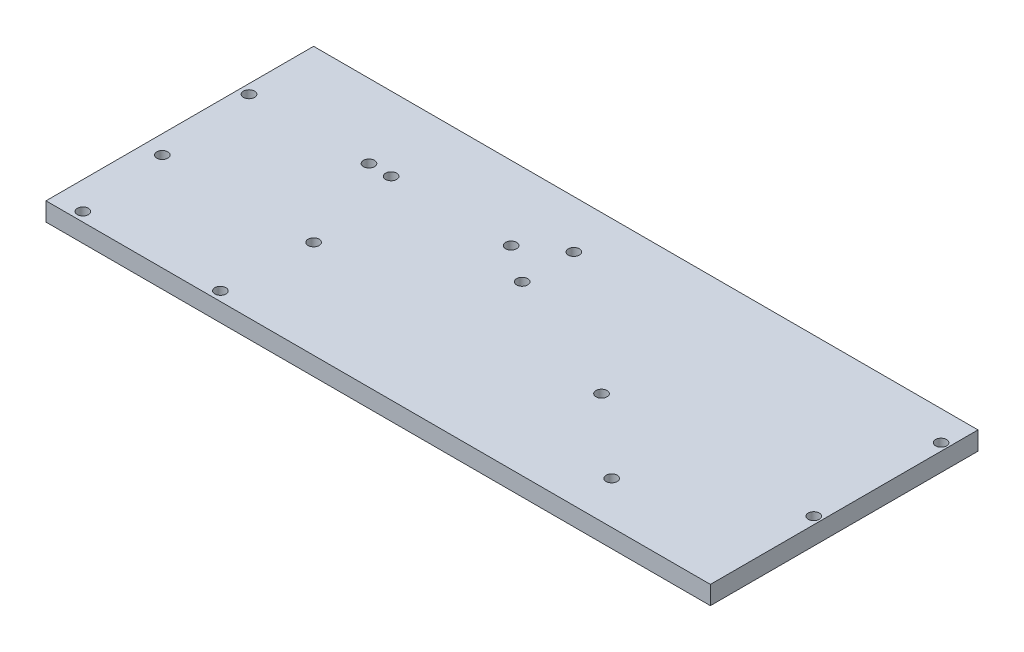
ISO-10303-21;
HEADER;
FILE_DESCRIPTION(('STEP AP214'),'2;1');
FILE_NAME('part.step','',(''),(''),'','','');
FILE_SCHEMA(('AUTOMOTIVE_DESIGN { 1 0 10303 214 1 1 1 1 }'));
ENDSEC;
DATA;
#1=APPLICATION_CONTEXT('core data for automotive mechanical design processes');
#2=APPLICATION_PROTOCOL_DEFINITION('international standard','automotive_design',2000,#1);
#3=PRODUCT_CONTEXT('',#1,'mechanical');
#4=PRODUCT('Part','Part','',(#3));
#5=PRODUCT_RELATED_PRODUCT_CATEGORY('part','',(#4));
#6=PRODUCT_DEFINITION_FORMATION('','',#4);
#7=PRODUCT_DEFINITION_CONTEXT('part definition',#1,'design');
#8=PRODUCT_DEFINITION('design','',#6,#7);
#9=PRODUCT_DEFINITION_SHAPE('','',#8);
#10=(LENGTH_UNIT() NAMED_UNIT(*) SI_UNIT(.MILLI.,.METRE.));
#11=(NAMED_UNIT(*) PLANE_ANGLE_UNIT() SI_UNIT($,.RADIAN.));
#12=(NAMED_UNIT(*) SI_UNIT($,.STERADIAN.) SOLID_ANGLE_UNIT());
#13=UNCERTAINTY_MEASURE_WITH_UNIT(LENGTH_MEASURE(1.E-05),#10,'distance_accuracy_value','');
#14=(GEOMETRIC_REPRESENTATION_CONTEXT(3) GLOBAL_UNCERTAINTY_ASSIGNED_CONTEXT((#13)) GLOBAL_UNIT_ASSIGNED_CONTEXT((#10,
#11,#12)) REPRESENTATION_CONTEXT('',''));
#15=CARTESIAN_POINT('',(0.,0.,0.));
#16=DIRECTION('',(0.,0.,1.));
#17=DIRECTION('',(1.,0.,0.));
#18=AXIS2_PLACEMENT_3D('',#15,#16,#17);
#19=CARTESIAN_POINT('',(0.,10.,0.));
#20=DIRECTION('',(0.,0.,-1.));
#21=DIRECTION('',(-1.,0.,0.));
#22=AXIS2_PLACEMENT_3D('',#19,#20,#21);
#23=PLANE('',#22);
#24=DIRECTION('',(1.,0.,0.));
#25=VECTOR('',#24,1.);
#26=CARTESIAN_POINT('',(0.,0.,0.));
#27=LINE('',#26,#25);
#28=CARTESIAN_POINT('',(0.,0.,0.));
#29=VERTEX_POINT('',#28);
#30=CARTESIAN_POINT('',(360.,0.,0.));
#31=VERTEX_POINT('',#30);
#32=EDGE_CURVE('E171',#29,#31,#27,.T.);
#33=ORIENTED_EDGE('',*,*,#32,.T.);
#34=DIRECTION('',(0.,-1.,0.));
#35=VECTOR('',#34,1.);
#36=CARTESIAN_POINT('',(360.,10.,0.));
#37=LINE('',#36,#35);
#38=CARTESIAN_POINT('',(360.,10.,0.));
#39=VERTEX_POINT('',#38);
#40=EDGE_CURVE('E11',#39,#31,#37,.T.);
#41=ORIENTED_EDGE('',*,*,#40,.F.);
#42=DIRECTION('',(1.,0.,0.));
#43=VECTOR('',#42,1.);
#44=CARTESIAN_POINT('',(0.,10.,0.));
#45=LINE('',#44,#43);
#46=CARTESIAN_POINT('',(0.,10.,0.));
#47=VERTEX_POINT('',#46);
#48=EDGE_CURVE('E97',#47,#39,#45,.T.);
#49=ORIENTED_EDGE('',*,*,#48,.F.);
#50=DIRECTION('',(0.,-1.,0.));
#51=VECTOR('',#50,1.);
#52=CARTESIAN_POINT('',(0.,10.,0.));
#53=LINE('',#52,#51);
#54=EDGE_CURVE('E63',#47,#29,#53,.T.);
#55=ORIENTED_EDGE('',*,*,#54,.T.);
#56=EDGE_LOOP('',(#33,#41,#49,#55));
#57=FACE_BOUND('',#56,.T.);
#58=ADVANCED_FACE('F45',(#57),#23,.F.);
#59=CARTESIAN_POINT('',(360.,10.,0.));
#60=DIRECTION('',(-1.,0.,0.));
#61=DIRECTION('',(0.,0.,1.));
#62=AXIS2_PLACEMENT_3D('',#59,#60,#61);
#63=PLANE('',#62);
#64=DIRECTION('',(0.,0.,-1.));
#65=VECTOR('',#64,1.);
#66=CARTESIAN_POINT('',(360.,0.,0.));
#67=LINE('',#66,#65);
#68=CARTESIAN_POINT('',(360.,0.,-145.));
#69=VERTEX_POINT('',#68);
#70=EDGE_CURVE('E103',#31,#69,#67,.T.);
#71=ORIENTED_EDGE('',*,*,#70,.T.);
#72=DIRECTION('',(0.,-1.,0.));
#73=VECTOR('',#72,1.);
#74=CARTESIAN_POINT('',(360.,10.,-145.));
#75=LINE('',#74,#73);
#76=CARTESIAN_POINT('',(360.,10.,-145.));
#77=VERTEX_POINT('',#76);
#78=EDGE_CURVE('E55',#77,#69,#75,.T.);
#79=ORIENTED_EDGE('',*,*,#78,.F.);
#80=DIRECTION('',(0.,0.,-1.));
#81=VECTOR('',#80,1.);
#82=CARTESIAN_POINT('',(360.,10.,0.));
#83=LINE('',#82,#81);
#84=EDGE_CURVE('E88',#39,#77,#83,.T.);
#85=ORIENTED_EDGE('',*,*,#84,.F.);
#86=ORIENTED_EDGE('',*,*,#40,.T.);
#87=EDGE_LOOP('',(#71,#79,#85,#86));
#88=FACE_BOUND('',#87,.T.);
#89=ADVANCED_FACE('F102',(#88),#63,.F.);
#90=CARTESIAN_POINT('',(0.,10.,-145.));
#91=DIRECTION('',(0.,0.,-1.));
#92=DIRECTION('',(-1.,0.,0.));
#93=AXIS2_PLACEMENT_3D('',#90,#91,#92);
#94=PLANE('',#93);
#95=DIRECTION('',(1.,0.,0.));
#96=VECTOR('',#95,1.);
#97=CARTESIAN_POINT('',(0.,0.,-145.));
#98=LINE('',#97,#96);
#99=CARTESIAN_POINT('',(0.,0.,-145.));
#100=VERTEX_POINT('',#99);
#101=EDGE_CURVE('E176',#100,#69,#98,.T.);
#102=ORIENTED_EDGE('',*,*,#101,.F.);
#103=DIRECTION('',(0.,-1.,0.));
#104=VECTOR('',#103,1.);
#105=CARTESIAN_POINT('',(0.,10.,-145.));
#106=LINE('',#105,#104);
#107=CARTESIAN_POINT('',(0.,10.,-145.));
#108=VERTEX_POINT('',#107);
#109=EDGE_CURVE('E77',#108,#100,#106,.T.);
#110=ORIENTED_EDGE('',*,*,#109,.F.);
#111=DIRECTION('',(1.,0.,0.));
#112=VECTOR('',#111,1.);
#113=CARTESIAN_POINT('',(0.,10.,-145.));
#114=LINE('',#113,#112);
#115=EDGE_CURVE('E96',#108,#77,#114,.T.);
#116=ORIENTED_EDGE('',*,*,#115,.T.);
#117=ORIENTED_EDGE('',*,*,#78,.T.);
#118=EDGE_LOOP('',(#102,#110,#116,#117));
#119=FACE_BOUND('',#118,.T.);
#120=ADVANCED_FACE('F107',(#119),#94,.T.);
#121=CARTESIAN_POINT('',(356.,10.,-129.));
#122=DIRECTION('',(0.,-1.,0.));
#123=DIRECTION('',(0.,0.,-1.));
#124=AXIS2_PLACEMENT_3D('',#121,#122,#123);
#125=CYLINDRICAL_SURFACE('',#124,2.99999999999999);
#126=CARTESIAN_POINT('',(356.,10.,-129.));
#127=DIRECTION('',(0.,1.,0.));
#128=DIRECTION('',(0.,0.,1.));
#129=AXIS2_PLACEMENT_3D('',#126,#127,#128);
#130=CIRCLE('',#129,2.99999999999999);
#131=CARTESIAN_POINT('',(356.,10.,-126.));
#132=VERTEX_POINT('',#131);
#133=EDGE_CURVE('E123',#132,#132,#130,.T.);
#134=ORIENTED_EDGE('',*,*,#133,.T.);
#135=EDGE_LOOP('',(#134));
#136=FACE_BOUND('',#135,.T.);
#137=CARTESIAN_POINT('',(356.,0.,-129.));
#138=DIRECTION('',(0.,1.,0.));
#139=DIRECTION('',(0.,0.,1.));
#140=AXIS2_PLACEMENT_3D('',#137,#138,#139);
#141=CIRCLE('',#140,2.99999999999999);
#142=CARTESIAN_POINT('',(356.,0.,-126.));
#143=VERTEX_POINT('',#142);
#144=EDGE_CURVE('E191',#143,#143,#141,.T.);
#145=ORIENTED_EDGE('',*,*,#144,.F.);
#146=EDGE_LOOP('',(#145));
#147=FACE_BOUND('',#146,.T.);
#148=ADVANCED_FACE('F338',(#136,#147),#125,.F.);
#149=CARTESIAN_POINT('',(241.,10.,-60.));
#150=DIRECTION('',(0.,-1.,0.));
#151=DIRECTION('',(0.,0.,-1.));
#152=AXIS2_PLACEMENT_3D('',#149,#150,#151);
#153=CYLINDRICAL_SURFACE('',#152,2.99999999999999);
#154=CARTESIAN_POINT('',(241.,10.,-60.));
#155=DIRECTION('',(0.,1.,0.));
#156=DIRECTION('',(0.,0.,1.));
#157=AXIS2_PLACEMENT_3D('',#154,#155,#156);
#158=CIRCLE('',#157,2.99999999999999);
#159=CARTESIAN_POINT('',(241.,10.,-57.));
#160=VERTEX_POINT('',#159);
#161=EDGE_CURVE('E119',#160,#160,#158,.T.);
#162=ORIENTED_EDGE('',*,*,#161,.T.);
#163=EDGE_LOOP('',(#162));
#164=FACE_BOUND('',#163,.T.);
#165=CARTESIAN_POINT('',(241.,0.,-60.));
#166=DIRECTION('',(0.,1.,0.));
#167=DIRECTION('',(0.,0.,1.));
#168=AXIS2_PLACEMENT_3D('',#165,#166,#167);
#169=CIRCLE('',#168,2.99999999999999);
#170=CARTESIAN_POINT('',(241.,0.,-57.));
#171=VERTEX_POINT('',#170);
#172=EDGE_CURVE('E187',#171,#171,#169,.T.);
#173=ORIENTED_EDGE('',*,*,#172,.F.);
#174=EDGE_LOOP('',(#173));
#175=FACE_BOUND('',#174,.T.);
#176=ADVANCED_FACE('F340',(#164,#175),#153,.F.);
#177=CARTESIAN_POINT('',(283.5,10.,-23.));
#178=DIRECTION('',(0.,-1.,0.));
#179=DIRECTION('',(0.,0.,-1.));
#180=AXIS2_PLACEMENT_3D('',#177,#178,#179);
#181=CYLINDRICAL_SURFACE('',#180,2.99999999999999);
#182=CARTESIAN_POINT('',(283.5,10.,-23.));
#183=DIRECTION('',(0.,1.,0.));
#184=DIRECTION('',(0.,0.,1.));
#185=AXIS2_PLACEMENT_3D('',#182,#183,#184);
#186=CIRCLE('',#185,2.99999999999999);
#187=CARTESIAN_POINT('',(283.5,10.,-20.));
#188=VERTEX_POINT('',#187);
#189=EDGE_CURVE('E112',#188,#188,#186,.T.);
#190=ORIENTED_EDGE('',*,*,#189,.T.);
#191=EDGE_LOOP('',(#190));
#192=FACE_BOUND('',#191,.T.);
#193=CARTESIAN_POINT('',(283.5,0.,-23.));
#194=DIRECTION('',(0.,1.,0.));
#195=DIRECTION('',(0.,0.,1.));
#196=AXIS2_PLACEMENT_3D('',#193,#194,#195);
#197=CIRCLE('',#196,2.99999999999999);
#198=CARTESIAN_POINT('',(283.5,0.,-20.));
#199=VERTEX_POINT('',#198);
#200=EDGE_CURVE('E183',#199,#199,#197,.T.);
#201=ORIENTED_EDGE('',*,*,#200,.F.);
#202=EDGE_LOOP('',(#201));
#203=FACE_BOUND('',#202,.T.);
#204=ADVANCED_FACE('F347',(#192,#203),#181,.F.);
#205=CARTESIAN_POINT('',(0.,10.,0.));
#206=DIRECTION('',(-1.,0.,0.));
#207=DIRECTION('',(0.,0.,1.));
#208=AXIS2_PLACEMENT_3D('',#205,#206,#207);
#209=PLANE('',#208);
#210=DIRECTION('',(0.,0.,-1.));
#211=VECTOR('',#210,1.);
#212=CARTESIAN_POINT('',(0.,0.,0.));
#213=LINE('',#212,#211);
#214=EDGE_CURVE('E179',#29,#100,#213,.T.);
#215=ORIENTED_EDGE('',*,*,#214,.F.);
#216=ORIENTED_EDGE('',*,*,#54,.F.);
#217=DIRECTION('',(0.,0.,-1.));
#218=VECTOR('',#217,1.);
#219=CARTESIAN_POINT('',(0.,10.,0.));
#220=LINE('',#219,#218);
#221=EDGE_CURVE('E109',#47,#108,#220,.T.);
#222=ORIENTED_EDGE('',*,*,#221,.T.);
#223=ORIENTED_EDGE('',*,*,#109,.T.);
#224=EDGE_LOOP('',(#215,#216,#222,#223));
#225=FACE_BOUND('',#224,.T.);
#226=ADVANCED_FACE('F277',(#225),#209,.T.);
#227=CARTESIAN_POINT('',(15.,10.,-5.));
#228=DIRECTION('',(0.,-1.,0.));
#229=DIRECTION('',(0.,0.,-1.));
#230=AXIS2_PLACEMENT_3D('',#227,#228,#229);
#231=CYLINDRICAL_SURFACE('',#230,3.);
#232=CARTESIAN_POINT('',(15.,10.,-5.));
#233=DIRECTION('',(0.,1.,0.));
#234=DIRECTION('',(0.,0.,1.));
#235=AXIS2_PLACEMENT_3D('',#232,#233,#234);
#236=CIRCLE('',#235,3.);
#237=CARTESIAN_POINT('',(15.,10.,-2.));
#238=VERTEX_POINT('',#237);
#239=EDGE_CURVE('E243',#238,#238,#236,.T.);
#240=ORIENTED_EDGE('',*,*,#239,.T.);
#241=EDGE_LOOP('',(#240));
#242=FACE_BOUND('',#241,.T.);
#243=CARTESIAN_POINT('',(15.,0.,-5.));
#244=DIRECTION('',(0.,1.,0.));
#245=DIRECTION('',(0.,0.,1.));
#246=AXIS2_PLACEMENT_3D('',#243,#244,#245);
#247=CIRCLE('',#246,3.);
#248=CARTESIAN_POINT('',(15.,0.,-2.));
#249=VERTEX_POINT('',#248);
#250=EDGE_CURVE('E167',#249,#249,#247,.T.);
#251=ORIENTED_EDGE('',*,*,#250,.F.);
#252=EDGE_LOOP('',(#251));
#253=FACE_BOUND('',#252,.T.);
#254=ADVANCED_FACE('F249',(#242,#253),#231,.F.);
#255=CARTESIAN_POINT('',(10.,10.,-53.));
#256=DIRECTION('',(0.,-1.,0.));
#257=DIRECTION('',(0.,0.,-1.));
#258=AXIS2_PLACEMENT_3D('',#255,#256,#257);
#259=CYLINDRICAL_SURFACE('',#258,3.);
#260=CARTESIAN_POINT('',(10.,10.,-53.));
#261=DIRECTION('',(0.,1.,0.));
#262=DIRECTION('',(0.,0.,1.));
#263=AXIS2_PLACEMENT_3D('',#260,#261,#262);
#264=CIRCLE('',#263,3.);
#265=CARTESIAN_POINT('',(10.,10.,-50.));
#266=VERTEX_POINT('',#265);
#267=EDGE_CURVE('E239',#266,#266,#264,.T.);
#268=ORIENTED_EDGE('',*,*,#267,.T.);
#269=EDGE_LOOP('',(#268));
#270=FACE_BOUND('',#269,.T.);
#271=CARTESIAN_POINT('',(10.,0.,-53.));
#272=DIRECTION('',(0.,1.,0.));
#273=DIRECTION('',(0.,0.,1.));
#274=AXIS2_PLACEMENT_3D('',#271,#272,#273);
#275=CIRCLE('',#274,3.);
#276=CARTESIAN_POINT('',(10.,0.,-50.));
#277=VERTEX_POINT('',#276);
#278=EDGE_CURVE('E163',#277,#277,#275,.T.);
#279=ORIENTED_EDGE('',*,*,#278,.F.);
#280=EDGE_LOOP('',(#279));
#281=FACE_BOUND('',#280,.T.);
#282=ADVANCED_FACE('F276',(#270,#281),#259,.F.);
#283=CARTESIAN_POINT('',(92.,10.,-53.));
#284=DIRECTION('',(0.,-1.,0.));
#285=DIRECTION('',(0.,0.,-1.));
#286=AXIS2_PLACEMENT_3D('',#283,#284,#285);
#287=CYLINDRICAL_SURFACE('',#286,2.99999999999999);
#288=CARTESIAN_POINT('',(92.,10.,-53.));
#289=DIRECTION('',(0.,1.,0.));
#290=DIRECTION('',(0.,0.,1.));
#291=AXIS2_PLACEMENT_3D('',#288,#289,#290);
#292=CIRCLE('',#291,2.99999999999999);
#293=CARTESIAN_POINT('',(92.,10.,-50.));
#294=VERTEX_POINT('',#293);
#295=EDGE_CURVE('E235',#294,#294,#292,.T.);
#296=ORIENTED_EDGE('',*,*,#295,.T.);
#297=EDGE_LOOP('',(#296));
#298=FACE_BOUND('',#297,.T.);
#299=CARTESIAN_POINT('',(92.,0.,-53.));
#300=DIRECTION('',(0.,1.,0.));
#301=DIRECTION('',(0.,0.,1.));
#302=AXIS2_PLACEMENT_3D('',#299,#300,#301);
#303=CIRCLE('',#302,2.99999999999999);
#304=CARTESIAN_POINT('',(92.,0.,-50.));
#305=VERTEX_POINT('',#304);
#306=EDGE_CURVE('E159',#305,#305,#303,.T.);
#307=ORIENTED_EDGE('',*,*,#306,.F.);
#308=EDGE_LOOP('',(#307));
#309=FACE_BOUND('',#308,.T.);
#310=ADVANCED_FACE('F280',(#298,#309),#287,.F.);
#311=CARTESIAN_POINT('',(89.5,10.,-5.));
#312=DIRECTION('',(0.,-1.,0.));
#313=DIRECTION('',(0.,0.,-1.));
#314=AXIS2_PLACEMENT_3D('',#311,#312,#313);
#315=CYLINDRICAL_SURFACE('',#314,2.99999999999999);
#316=CARTESIAN_POINT('',(89.5,10.,-5.));
#317=DIRECTION('',(0.,1.,0.));
#318=DIRECTION('',(0.,0.,1.));
#319=AXIS2_PLACEMENT_3D('',#316,#317,#318);
#320=CIRCLE('',#319,2.99999999999999);
#321=CARTESIAN_POINT('',(89.5,10.,-2.00000000000001));
#322=VERTEX_POINT('',#321);
#323=EDGE_CURVE('E231',#322,#322,#320,.T.);
#324=ORIENTED_EDGE('',*,*,#323,.T.);
#325=EDGE_LOOP('',(#324));
#326=FACE_BOUND('',#325,.T.);
#327=CARTESIAN_POINT('',(89.5,0.,-5.));
#328=DIRECTION('',(0.,1.,0.));
#329=DIRECTION('',(0.,0.,1.));
#330=AXIS2_PLACEMENT_3D('',#327,#328,#329);
#331=CIRCLE('',#330,2.99999999999999);
#332=CARTESIAN_POINT('',(89.5,0.,-2.00000000000001));
#333=VERTEX_POINT('',#332);
#334=EDGE_CURVE('E155',#333,#333,#331,.T.);
#335=ORIENTED_EDGE('',*,*,#334,.F.);
#336=EDGE_LOOP('',(#335));
#337=FACE_BOUND('',#336,.T.);
#338=ADVANCED_FACE('F284',(#326,#337),#315,.F.);
#339=CARTESIAN_POINT('',(5.,10.,-105.));
#340=DIRECTION('',(0.,-1.,0.));
#341=DIRECTION('',(0.,0.,-1.));
#342=AXIS2_PLACEMENT_3D('',#339,#340,#341);
#343=CYLINDRICAL_SURFACE('',#342,3.);
#344=CARTESIAN_POINT('',(5.,10.,-105.));
#345=DIRECTION('',(0.,1.,0.));
#346=DIRECTION('',(0.,0.,1.));
#347=AXIS2_PLACEMENT_3D('',#344,#345,#346);
#348=CIRCLE('',#347,3.);
#349=CARTESIAN_POINT('',(5.,10.,-102.));
#350=VERTEX_POINT('',#349);
#351=EDGE_CURVE('E227',#350,#350,#348,.T.);
#352=ORIENTED_EDGE('',*,*,#351,.T.);
#353=EDGE_LOOP('',(#352));
#354=FACE_BOUND('',#353,.T.);
#355=CARTESIAN_POINT('',(5.,0.,-105.));
#356=DIRECTION('',(0.,1.,0.));
#357=DIRECTION('',(0.,0.,1.));
#358=AXIS2_PLACEMENT_3D('',#355,#356,#357);
#359=CIRCLE('',#358,3.);
#360=CARTESIAN_POINT('',(5.,0.,-102.));
#361=VERTEX_POINT('',#360);
#362=EDGE_CURVE('E151',#361,#361,#359,.T.);
#363=ORIENTED_EDGE('',*,*,#362,.F.);
#364=EDGE_LOOP('',(#363));
#365=FACE_BOUND('',#364,.T.);
#366=ADVANCED_FACE('F288',(#354,#365),#343,.F.);
#367=CARTESIAN_POINT('',(70.,10.,-105.));
#368=DIRECTION('',(0.,-1.,0.));
#369=DIRECTION('',(0.,0.,-1.));
#370=AXIS2_PLACEMENT_3D('',#367,#368,#369);
#371=CYLINDRICAL_SURFACE('',#370,3.00000000000001);
#372=CARTESIAN_POINT('',(70.,10.,-105.));
#373=DIRECTION('',(0.,1.,0.));
#374=DIRECTION('',(0.,0.,1.));
#375=AXIS2_PLACEMENT_3D('',#372,#373,#374);
#376=CIRCLE('',#375,3.00000000000001);
#377=CARTESIAN_POINT('',(70.,10.,-102.));
#378=VERTEX_POINT('',#377);
#379=EDGE_CURVE('E223',#378,#378,#376,.T.);
#380=ORIENTED_EDGE('',*,*,#379,.T.);
#381=EDGE_LOOP('',(#380));
#382=FACE_BOUND('',#381,.T.);
#383=CARTESIAN_POINT('',(70.,0.,-105.));
#384=DIRECTION('',(0.,1.,0.));
#385=DIRECTION('',(0.,0.,1.));
#386=AXIS2_PLACEMENT_3D('',#383,#384,#385);
#387=CIRCLE('',#386,3.00000000000001);
#388=CARTESIAN_POINT('',(70.,0.,-102.));
#389=VERTEX_POINT('',#388);
#390=EDGE_CURVE('E147',#389,#389,#387,.T.);
#391=ORIENTED_EDGE('',*,*,#390,.F.);
#392=EDGE_LOOP('',(#391));
#393=FACE_BOUND('',#392,.T.);
#394=ADVANCED_FACE('F292',(#382,#393),#371,.F.);
#395=CARTESIAN_POINT('',(82.,10.,-105.));
#396=DIRECTION('',(0.,-1.,0.));
#397=DIRECTION('',(0.,0.,-1.));
#398=AXIS2_PLACEMENT_3D('',#395,#396,#397);
#399=CYLINDRICAL_SURFACE('',#398,3.00000000000001);
#400=CARTESIAN_POINT('',(82.,10.,-105.));
#401=DIRECTION('',(0.,1.,0.));
#402=DIRECTION('',(0.,0.,1.));
#403=AXIS2_PLACEMENT_3D('',#400,#401,#402);
#404=CIRCLE('',#403,3.00000000000001);
#405=CARTESIAN_POINT('',(82.,10.,-102.));
#406=VERTEX_POINT('',#405);
#407=EDGE_CURVE('E219',#406,#406,#404,.T.);
#408=ORIENTED_EDGE('',*,*,#407,.T.);
#409=EDGE_LOOP('',(#408));
#410=FACE_BOUND('',#409,.T.);
#411=CARTESIAN_POINT('',(82.,0.,-105.));
#412=DIRECTION('',(0.,1.,0.));
#413=DIRECTION('',(0.,0.,1.));
#414=AXIS2_PLACEMENT_3D('',#411,#412,#413);
#415=CIRCLE('',#414,3.00000000000001);
#416=CARTESIAN_POINT('',(82.,0.,-102.));
#417=VERTEX_POINT('',#416);
#418=EDGE_CURVE('E143',#417,#417,#415,.T.);
#419=ORIENTED_EDGE('',*,*,#418,.F.);
#420=EDGE_LOOP('',(#419));
#421=FACE_BOUND('',#420,.T.);
#422=ADVANCED_FACE('F296',(#410,#421),#399,.F.);
#423=CARTESIAN_POINT('',(147.,10.,-105.));
#424=DIRECTION('',(0.,-1.,0.));
#425=DIRECTION('',(0.,0.,-1.));
#426=AXIS2_PLACEMENT_3D('',#423,#424,#425);
#427=CYLINDRICAL_SURFACE('',#426,2.99999999999999);
#428=CARTESIAN_POINT('',(147.,10.,-105.));
#429=DIRECTION('',(0.,1.,0.));
#430=DIRECTION('',(0.,0.,1.));
#431=AXIS2_PLACEMENT_3D('',#428,#429,#430);
#432=CIRCLE('',#431,2.99999999999999);
#433=CARTESIAN_POINT('',(147.,10.,-102.));
#434=VERTEX_POINT('',#433);
#435=EDGE_CURVE('E213',#434,#434,#432,.T.);
#436=ORIENTED_EDGE('',*,*,#435,.T.);
#437=EDGE_LOOP('',(#436));
#438=FACE_BOUND('',#437,.T.);
#439=CARTESIAN_POINT('',(147.,0.,-105.));
#440=DIRECTION('',(0.,1.,0.));
#441=DIRECTION('',(0.,0.,1.));
#442=AXIS2_PLACEMENT_3D('',#439,#440,#441);
#443=CIRCLE('',#442,2.99999999999999);
#444=CARTESIAN_POINT('',(147.,0.,-102.));
#445=VERTEX_POINT('',#444);
#446=EDGE_CURVE('E139',#445,#445,#443,.T.);
#447=ORIENTED_EDGE('',*,*,#446,.F.);
#448=EDGE_LOOP('',(#447));
#449=FACE_BOUND('',#448,.T.);
#450=ADVANCED_FACE('F300',(#438,#449),#427,.F.);
#451=CARTESIAN_POINT('',(167.,10.,-91.));
#452=DIRECTION('',(0.,-1.,0.));
#453=DIRECTION('',(0.,0.,-1.));
#454=AXIS2_PLACEMENT_3D('',#451,#452,#453);
#455=CYLINDRICAL_SURFACE('',#454,2.99999999999999);
#456=CARTESIAN_POINT('',(167.,10.,-91.));
#457=DIRECTION('',(0.,1.,0.));
#458=DIRECTION('',(0.,0.,1.));
#459=AXIS2_PLACEMENT_3D('',#456,#457,#458);
#460=CIRCLE('',#459,2.99999999999999);
#461=CARTESIAN_POINT('',(167.,10.,-88.));
#462=VERTEX_POINT('',#461);
#463=EDGE_CURVE('E207',#462,#462,#460,.T.);
#464=ORIENTED_EDGE('',*,*,#463,.T.);
#465=EDGE_LOOP('',(#464));
#466=FACE_BOUND('',#465,.T.);
#467=CARTESIAN_POINT('',(167.,0.,-91.));
#468=DIRECTION('',(0.,1.,0.));
#469=DIRECTION('',(0.,0.,1.));
#470=AXIS2_PLACEMENT_3D('',#467,#468,#469);
#471=CIRCLE('',#470,2.99999999999999);
#472=CARTESIAN_POINT('',(167.,0.,-88.));
#473=VERTEX_POINT('',#472);
#474=EDGE_CURVE('E135',#473,#473,#471,.T.);
#475=ORIENTED_EDGE('',*,*,#474,.F.);
#476=EDGE_LOOP('',(#475));
#477=FACE_BOUND('',#476,.T.);
#478=ADVANCED_FACE('F303',(#466,#477),#455,.F.);
#479=CARTESIAN_POINT('',(167.,10.,-119.));
#480=DIRECTION('',(0.,-1.,0.));
#481=DIRECTION('',(0.,0.,-1.));
#482=AXIS2_PLACEMENT_3D('',#479,#480,#481);
#483=CYLINDRICAL_SURFACE('',#482,2.99999999999999);
#484=CARTESIAN_POINT('',(167.,10.,-119.));
#485=DIRECTION('',(0.,1.,0.));
#486=DIRECTION('',(0.,0.,1.));
#487=AXIS2_PLACEMENT_3D('',#484,#485,#486);
#488=CIRCLE('',#487,2.99999999999999);
#489=CARTESIAN_POINT('',(167.,10.,-116.));
#490=VERTEX_POINT('',#489);
#491=EDGE_CURVE('E199',#490,#490,#488,.T.);
#492=ORIENTED_EDGE('',*,*,#491,.T.);
#493=EDGE_LOOP('',(#492));
#494=FACE_BOUND('',#493,.T.);
#495=CARTESIAN_POINT('',(167.,0.,-119.));
#496=DIRECTION('',(0.,1.,0.));
#497=DIRECTION('',(0.,0.,1.));
#498=AXIS2_PLACEMENT_3D('',#495,#496,#497);
#499=CIRCLE('',#498,2.99999999999999);
#500=CARTESIAN_POINT('',(167.,0.,-116.));
#501=VERTEX_POINT('',#500);
#502=EDGE_CURVE('E131',#501,#501,#499,.T.);
#503=ORIENTED_EDGE('',*,*,#502,.F.);
#504=EDGE_LOOP('',(#503));
#505=FACE_BOUND('',#504,.T.);
#506=ADVANCED_FACE('F47',(#494,#505),#483,.F.);
#507=CARTESIAN_POINT('',(356.,10.,-60.));
#508=DIRECTION('',(0.,-1.,0.));
#509=DIRECTION('',(0.,0.,-1.));
#510=AXIS2_PLACEMENT_3D('',#507,#508,#509);
#511=CYLINDRICAL_SURFACE('',#510,2.99999999999999);
#512=CARTESIAN_POINT('',(356.,10.,-60.));
#513=DIRECTION('',(0.,1.,0.));
#514=DIRECTION('',(0.,0.,1.));
#515=AXIS2_PLACEMENT_3D('',#512,#513,#514);
#516=CIRCLE('',#515,2.99999999999999);
#517=CARTESIAN_POINT('',(356.,10.,-57.));
#518=VERTEX_POINT('',#517);
#519=EDGE_CURVE('E127',#518,#518,#516,.T.);
#520=ORIENTED_EDGE('',*,*,#519,.T.);
#521=EDGE_LOOP('',(#520));
#522=FACE_BOUND('',#521,.T.);
#523=CARTESIAN_POINT('',(356.,0.,-60.));
#524=DIRECTION('',(0.,1.,0.));
#525=DIRECTION('',(0.,0.,1.));
#526=AXIS2_PLACEMENT_3D('',#523,#524,#525);
#527=CIRCLE('',#526,2.99999999999999);
#528=CARTESIAN_POINT('',(356.,0.,-57.));
#529=VERTEX_POINT('',#528);
#530=EDGE_CURVE('E195',#529,#529,#527,.T.);
#531=ORIENTED_EDGE('',*,*,#530,.F.);
#532=EDGE_LOOP('',(#531));
#533=FACE_BOUND('',#532,.T.);
#534=ADVANCED_FACE('F254',(#522,#533),#511,.F.);
#535=CARTESIAN_POINT('',(0.,10.,0.));
#536=DIRECTION('',(0.,1.,0.));
#537=DIRECTION('',(0.,0.,1.));
#538=AXIS2_PLACEMENT_3D('',#535,#536,#537);
#539=PLANE('',#538);
#540=ORIENTED_EDGE('',*,*,#491,.F.);
#541=EDGE_LOOP('',(#540));
#542=FACE_BOUND('',#541,.T.);
#543=ORIENTED_EDGE('',*,*,#463,.F.);
#544=EDGE_LOOP('',(#543));
#545=FACE_BOUND('',#544,.T.);
#546=ORIENTED_EDGE('',*,*,#435,.F.);
#547=EDGE_LOOP('',(#546));
#548=FACE_BOUND('',#547,.T.);
#549=ORIENTED_EDGE('',*,*,#407,.F.);
#550=EDGE_LOOP('',(#549));
#551=FACE_BOUND('',#550,.T.);
#552=ORIENTED_EDGE('',*,*,#379,.F.);
#553=EDGE_LOOP('',(#552));
#554=FACE_BOUND('',#553,.T.);
#555=ORIENTED_EDGE('',*,*,#351,.F.);
#556=EDGE_LOOP('',(#555));
#557=FACE_BOUND('',#556,.T.);
#558=ORIENTED_EDGE('',*,*,#323,.F.);
#559=EDGE_LOOP('',(#558));
#560=FACE_BOUND('',#559,.T.);
#561=ORIENTED_EDGE('',*,*,#295,.F.);
#562=EDGE_LOOP('',(#561));
#563=FACE_BOUND('',#562,.T.);
#564=ORIENTED_EDGE('',*,*,#267,.F.);
#565=EDGE_LOOP('',(#564));
#566=FACE_BOUND('',#565,.T.);
#567=ORIENTED_EDGE('',*,*,#239,.F.);
#568=EDGE_LOOP('',(#567));
#569=FACE_BOUND('',#568,.T.);
#570=ORIENTED_EDGE('',*,*,#48,.T.);
#571=ORIENTED_EDGE('',*,*,#84,.T.);
#572=ORIENTED_EDGE('',*,*,#115,.F.);
#573=ORIENTED_EDGE('',*,*,#221,.F.);
#574=EDGE_LOOP('',(#570,#571,#572,#573));
#575=FACE_BOUND('',#574,.T.);
#576=ORIENTED_EDGE('',*,*,#189,.F.);
#577=EDGE_LOOP('',(#576));
#578=FACE_BOUND('',#577,.T.);
#579=ORIENTED_EDGE('',*,*,#161,.F.);
#580=EDGE_LOOP('',(#579));
#581=FACE_BOUND('',#580,.T.);
#582=ORIENTED_EDGE('',*,*,#133,.F.);
#583=EDGE_LOOP('',(#582));
#584=FACE_BOUND('',#583,.T.);
#585=ORIENTED_EDGE('',*,*,#519,.F.);
#586=EDGE_LOOP('',(#585));
#587=FACE_BOUND('',#586,.T.);
#588=ADVANCED_FACE('F92',(#542,#545,#548,#551,#554,#557,#560,#563,#566,#569,#575,#578,#581,#584,
#587),#539,.T.);
#589=CARTESIAN_POINT('',(0.,0.,0.));
#590=DIRECTION('',(0.,1.,0.));
#591=DIRECTION('',(0.,0.,1.));
#592=AXIS2_PLACEMENT_3D('',#589,#590,#591);
#593=PLANE('',#592);
#594=ORIENTED_EDGE('',*,*,#502,.T.);
#595=EDGE_LOOP('',(#594));
#596=FACE_BOUND('',#595,.T.);
#597=ORIENTED_EDGE('',*,*,#474,.T.);
#598=EDGE_LOOP('',(#597));
#599=FACE_BOUND('',#598,.T.);
#600=ORIENTED_EDGE('',*,*,#446,.T.);
#601=EDGE_LOOP('',(#600));
#602=FACE_BOUND('',#601,.T.);
#603=ORIENTED_EDGE('',*,*,#418,.T.);
#604=EDGE_LOOP('',(#603));
#605=FACE_BOUND('',#604,.T.);
#606=ORIENTED_EDGE('',*,*,#390,.T.);
#607=EDGE_LOOP('',(#606));
#608=FACE_BOUND('',#607,.T.);
#609=ORIENTED_EDGE('',*,*,#362,.T.);
#610=EDGE_LOOP('',(#609));
#611=FACE_BOUND('',#610,.T.);
#612=ORIENTED_EDGE('',*,*,#334,.T.);
#613=EDGE_LOOP('',(#612));
#614=FACE_BOUND('',#613,.T.);
#615=ORIENTED_EDGE('',*,*,#306,.T.);
#616=EDGE_LOOP('',(#615));
#617=FACE_BOUND('',#616,.T.);
#618=ORIENTED_EDGE('',*,*,#278,.T.);
#619=EDGE_LOOP('',(#618));
#620=FACE_BOUND('',#619,.T.);
#621=ORIENTED_EDGE('',*,*,#250,.T.);
#622=EDGE_LOOP('',(#621));
#623=FACE_BOUND('',#622,.T.);
#624=ORIENTED_EDGE('',*,*,#32,.F.);
#625=ORIENTED_EDGE('',*,*,#214,.T.);
#626=ORIENTED_EDGE('',*,*,#101,.T.);
#627=ORIENTED_EDGE('',*,*,#70,.F.);
#628=EDGE_LOOP('',(#624,#625,#626,#627));
#629=FACE_BOUND('',#628,.T.);
#630=ORIENTED_EDGE('',*,*,#200,.T.);
#631=EDGE_LOOP('',(#630));
#632=FACE_BOUND('',#631,.T.);
#633=ORIENTED_EDGE('',*,*,#172,.T.);
#634=EDGE_LOOP('',(#633));
#635=FACE_BOUND('',#634,.T.);
#636=ORIENTED_EDGE('',*,*,#144,.T.);
#637=EDGE_LOOP('',(#636));
#638=FACE_BOUND('',#637,.T.);
#639=ORIENTED_EDGE('',*,*,#530,.T.);
#640=EDGE_LOOP('',(#639));
#641=FACE_BOUND('',#640,.T.);
#642=ADVANCED_FACE('F253',(#596,#599,#602,#605,#608,#611,#614,#617,#620,#623,#629,#632,#635,
#638,#641),#593,.F.);
#643=CLOSED_SHELL('',(#58,#89,#120,#148,#176,#204,#226,#254,#282,#310,#338,#366,#394,#422,#450,
#478,#506,#534,#588,#642));
#644=MANIFOLD_SOLID_BREP('B2',#643);
#645=ADVANCED_BREP_SHAPE_REPRESENTATION('',(#18,#644),#14);
#646=SHAPE_DEFINITION_REPRESENTATION(#9,#645);
ENDSEC;
END-ISO-10303-21;
